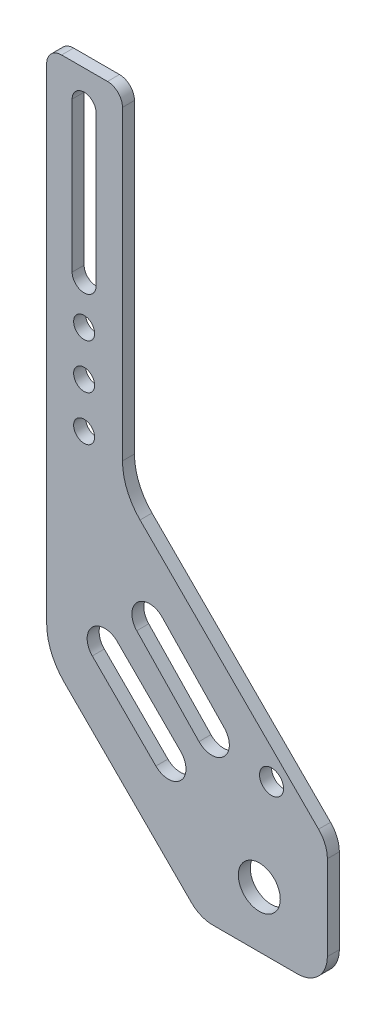
ISO-10303-21;
HEADER;
FILE_DESCRIPTION(('STEP AP214'),'2;1');
FILE_NAME('part.step','',(''),(''),'','','');
FILE_SCHEMA(('AUTOMOTIVE_DESIGN { 1 0 10303 214 1 1 1 1 }'));
ENDSEC;
DATA;
#1=APPLICATION_CONTEXT('core data for automotive mechanical design processes');
#2=APPLICATION_PROTOCOL_DEFINITION('international standard','automotive_design',2000,#1);
#3=PRODUCT_CONTEXT('',#1,'mechanical');
#4=PRODUCT('Part','Part','',(#3));
#5=PRODUCT_RELATED_PRODUCT_CATEGORY('part','',(#4));
#6=PRODUCT_DEFINITION_FORMATION('','',#4);
#7=PRODUCT_DEFINITION_CONTEXT('part definition',#1,'design');
#8=PRODUCT_DEFINITION('design','',#6,#7);
#9=PRODUCT_DEFINITION_SHAPE('','',#8);
#10=(LENGTH_UNIT() NAMED_UNIT(*) SI_UNIT(.MILLI.,.METRE.));
#11=(NAMED_UNIT(*) PLANE_ANGLE_UNIT() SI_UNIT($,.RADIAN.));
#12=(NAMED_UNIT(*) SI_UNIT($,.STERADIAN.) SOLID_ANGLE_UNIT());
#13=UNCERTAINTY_MEASURE_WITH_UNIT(LENGTH_MEASURE(1.E-05),#10,'distance_accuracy_value','');
#14=(GEOMETRIC_REPRESENTATION_CONTEXT(3) GLOBAL_UNCERTAINTY_ASSIGNED_CONTEXT((#13)) GLOBAL_UNIT_ASSIGNED_CONTEXT((#10,
#11,#12)) REPRESENTATION_CONTEXT('',''));
#15=CARTESIAN_POINT('',(0.,0.,0.));
#16=DIRECTION('',(0.,0.,1.));
#17=DIRECTION('',(1.,0.,0.));
#18=AXIS2_PLACEMENT_3D('',#15,#16,#17);
#19=CARTESIAN_POINT('',(0.,-96.2377499931107,4.));
#20=DIRECTION('',(0.,1.,0.));
#21=DIRECTION('',(0.,0.,1.));
#22=AXIS2_PLACEMENT_3D('',#19,#20,#21);
#23=PLANE('',#22);
#24=DIRECTION('',(1.,0.,0.));
#25=VECTOR('',#24,1.);
#26=CARTESIAN_POINT('',(0.,-96.2377499931107,0.));
#27=LINE('',#26,#25);
#28=CARTESIAN_POINT('',(55.3798856168415,-96.2377499931107,0.));
#29=VERTEX_POINT('',#28);
#30=CARTESIAN_POINT('',(83.6641568643034,-96.2377499931107,0.));
#31=VERTEX_POINT('',#30);
#32=EDGE_CURVE('E299',#29,#31,#27,.T.);
#33=ORIENTED_EDGE('',*,*,#32,.T.);
#34=DIRECTION('',(0.,0.,-1.));
#35=VECTOR('',#34,1.);
#36=CARTESIAN_POINT('',(83.6641568643034,-96.2377499931107,4.));
#37=LINE('',#36,#35);
#38=CARTESIAN_POINT('',(83.6641568643034,-96.2377499931107,4.));
#39=VERTEX_POINT('',#38);
#40=EDGE_CURVE('E11',#39,#31,#37,.T.);
#41=ORIENTED_EDGE('',*,*,#40,.F.);
#42=DIRECTION('',(1.,0.,0.));
#43=VECTOR('',#42,1.);
#44=CARTESIAN_POINT('',(0.,-96.2377499931107,4.));
#45=LINE('',#44,#43);
#46=CARTESIAN_POINT('',(55.3798856168415,-96.2377499931107,4.));
#47=VERTEX_POINT('',#46);
#48=EDGE_CURVE('E441',#47,#39,#45,.T.);
#49=ORIENTED_EDGE('',*,*,#48,.F.);
#50=DIRECTION('',(0.,0.,-1.));
#51=VECTOR('',#50,1.);
#52=CARTESIAN_POINT('',(55.3798856168415,-96.2377499931107,4.));
#53=LINE('',#52,#51);
#54=EDGE_CURVE('E331',#47,#29,#53,.T.);
#55=ORIENTED_EDGE('',*,*,#54,.T.);
#56=EDGE_LOOP('',(#33,#41,#49,#55));
#57=FACE_BOUND('',#56,.T.);
#58=ADVANCED_FACE('F41',(#57),#23,.F.);
#59=CARTESIAN_POINT('',(83.6641568643035,-86.2377499931107,4.));
#60=DIRECTION('',(0.,0.,-1.));
#61=DIRECTION('',(-1.,0.,0.));
#62=AXIS2_PLACEMENT_3D('',#59,#60,#61);
#63=CYLINDRICAL_SURFACE('',#62,9.99999999999999);
#64=CARTESIAN_POINT('',(83.6641568643035,-86.2377499931107,0.));
#65=DIRECTION('',(0.,0.,1.));
#66=DIRECTION('',(1.,0.,0.));
#67=AXIS2_PLACEMENT_3D('',#64,#65,#66);
#68=CIRCLE('',#67,9.99999999999999);
#69=CARTESIAN_POINT('',(93.6641568643035,-86.2377499931106,0.));
#70=VERTEX_POINT('',#69);
#71=EDGE_CURVE('E302',#31,#70,#68,.T.);
#72=ORIENTED_EDGE('',*,*,#71,.T.);
#73=DIRECTION('',(0.,0.,-1.));
#74=VECTOR('',#73,1.);
#75=CARTESIAN_POINT('',(93.6641568643035,-86.2377499931106,4.));
#76=LINE('',#75,#74);
#77=CARTESIAN_POINT('',(93.6641568643035,-86.2377499931106,4.));
#78=VERTEX_POINT('',#77);
#79=EDGE_CURVE('E51',#78,#70,#76,.T.);
#80=ORIENTED_EDGE('',*,*,#79,.F.);
#81=CARTESIAN_POINT('',(83.6641568643035,-86.2377499931107,4.));
#82=DIRECTION('',(0.,0.,1.));
#83=DIRECTION('',(1.,0.,0.));
#84=AXIS2_PLACEMENT_3D('',#81,#82,#83);
#85=CIRCLE('',#84,9.99999999999999);
#86=EDGE_CURVE('E443',#39,#78,#85,.T.);
#87=ORIENTED_EDGE('',*,*,#86,.F.);
#88=ORIENTED_EDGE('',*,*,#40,.T.);
#89=EDGE_LOOP('',(#72,#80,#87,#88));
#90=FACE_BOUND('',#89,.T.);
#91=ADVANCED_FACE('F486',(#90),#63,.T.);
#92=CARTESIAN_POINT('',(93.6641568643035,0.,4.));
#93=DIRECTION('',(-1.,0.,0.));
#94=DIRECTION('',(0.,0.,1.));
#95=AXIS2_PLACEMENT_3D('',#92,#93,#94);
#96=PLANE('',#95);
#97=DIRECTION('',(0.,1.,0.));
#98=VECTOR('',#97,1.);
#99=CARTESIAN_POINT('',(93.6641568643035,0.,0.));
#100=LINE('',#99,#98);
#101=CARTESIAN_POINT('',(93.6641568643035,-57.9534787456488,0.));
#102=VERTEX_POINT('',#101);
#103=EDGE_CURVE('E304',#70,#102,#100,.T.);
#104=ORIENTED_EDGE('',*,*,#103,.T.);
#105=DIRECTION('',(0.,0.,-1.));
#106=VECTOR('',#105,1.);
#107=CARTESIAN_POINT('',(93.6641568643035,-57.9534787456488,4.));
#108=LINE('',#107,#106);
#109=CARTESIAN_POINT('',(93.6641568643035,-57.9534787456488,4.));
#110=VERTEX_POINT('',#109);
#111=EDGE_CURVE('E353',#110,#102,#108,.T.);
#112=ORIENTED_EDGE('',*,*,#111,.F.);
#113=DIRECTION('',(0.,1.,0.));
#114=VECTOR('',#113,1.);
#115=CARTESIAN_POINT('',(93.6641568643035,0.,4.));
#116=LINE('',#115,#114);
#117=EDGE_CURVE('E445',#78,#110,#116,.T.);
#118=ORIENTED_EDGE('',*,*,#117,.F.);
#119=ORIENTED_EDGE('',*,*,#79,.T.);
#120=EDGE_LOOP('',(#104,#112,#118,#119));
#121=FACE_BOUND('',#120,.T.);
#122=ADVANCED_FACE('F491',(#121),#96,.F.);
#123=CARTESIAN_POINT('',(83.6641568643035,-57.9534787456487,4.));
#124=DIRECTION('',(0.,0.,-1.));
#125=DIRECTION('',(-1.,0.,0.));
#126=AXIS2_PLACEMENT_3D('',#123,#124,#125);
#127=CYLINDRICAL_SURFACE('',#126,10.);
#128=CARTESIAN_POINT('',(83.6641568643035,-57.9534787456487,0.));
#129=DIRECTION('',(0.,0.,1.));
#130=DIRECTION('',(1.,0.,0.));
#131=AXIS2_PLACEMENT_3D('',#128,#129,#130);
#132=CIRCLE('',#131,10.);
#133=CARTESIAN_POINT('',(90.7352246761689,-50.8824109337832,0.));
#134=VERTEX_POINT('',#133);
#135=EDGE_CURVE('E306',#102,#134,#132,.T.);
#136=ORIENTED_EDGE('',*,*,#135,.T.);
#137=DIRECTION('',(0.,0.,-1.));
#138=VECTOR('',#137,1.);
#139=CARTESIAN_POINT('',(90.7352246761689,-50.8824109337832,4.));
#140=LINE('',#139,#138);
#141=CARTESIAN_POINT('',(90.7352246761689,-50.8824109337832,4.));
#142=VERTEX_POINT('',#141);
#143=EDGE_CURVE('E350',#142,#134,#140,.T.);
#144=ORIENTED_EDGE('',*,*,#143,.F.);
#145=CARTESIAN_POINT('',(83.6641568643035,-57.9534787456487,4.));
#146=DIRECTION('',(0.,0.,1.));
#147=DIRECTION('',(1.,0.,0.));
#148=AXIS2_PLACEMENT_3D('',#145,#146,#147);
#149=CIRCLE('',#148,10.);
#150=EDGE_CURVE('E447',#110,#142,#149,.T.);
#151=ORIENTED_EDGE('',*,*,#150,.F.);
#152=ORIENTED_EDGE('',*,*,#111,.T.);
#153=EDGE_LOOP('',(#136,#144,#151,#152));
#154=FACE_BOUND('',#153,.T.);
#155=ADVANCED_FACE('F642',(#154),#127,.T.);
#156=CARTESIAN_POINT('',(19.9264068711924,19.9264068711926,4.));
#157=DIRECTION('',(-0.707106781186544,-0.707106781186551,0.));
#158=DIRECTION('',(0.707106781186551,-0.707106781186544,0.));
#159=AXIS2_PLACEMENT_3D('',#156,#157,#158);
#160=PLANE('',#159);
#161=DIRECTION('',(-0.707106781186551,0.707106781186544,0.));
#162=VECTOR('',#161,1.);
#163=CARTESIAN_POINT('',(19.9264068711924,19.9264068711926,0.));
#164=LINE('',#163,#162);
#165=CARTESIAN_POINT('',(31.159701747021,8.69311199536404,0.));
#166=VERTEX_POINT('',#165);
#167=EDGE_CURVE('E308',#134,#166,#164,.T.);
#168=ORIENTED_EDGE('',*,*,#167,.T.);
#169=DIRECTION('',(0.,0.,-1.));
#170=VECTOR('',#169,1.);
#171=CARTESIAN_POINT('',(31.159701747021,8.69311199536404,4.));
#172=LINE('',#171,#170);
#173=CARTESIAN_POINT('',(31.159701747021,8.69311199536404,4.));
#174=VERTEX_POINT('',#173);
#175=EDGE_CURVE('E347',#174,#166,#172,.T.);
#176=ORIENTED_EDGE('',*,*,#175,.F.);
#177=DIRECTION('',(-0.707106781186551,0.707106781186544,0.));
#178=VECTOR('',#177,1.);
#179=CARTESIAN_POINT('',(19.9264068711924,19.9264068711926,4.));
#180=LINE('',#179,#178);
#181=EDGE_CURVE('E449',#142,#174,#180,.T.);
#182=ORIENTED_EDGE('',*,*,#181,.F.);
#183=ORIENTED_EDGE('',*,*,#143,.T.);
#184=EDGE_LOOP('',(#168,#176,#182,#183));
#185=FACE_BOUND('',#184,.T.);
#186=ADVANCED_FACE('F634',(#185),#160,.F.);
#187=CARTESIAN_POINT('',(45.3018373707518,22.8352476190951,4.));
#188=DIRECTION('',(0.,0.,-1.));
#189=DIRECTION('',(-1.,0.,0.));
#190=AXIS2_PLACEMENT_3D('',#187,#188,#189);
#191=CYLINDRICAL_SURFACE('',#190,20.);
#192=CARTESIAN_POINT('',(45.3018373707518,22.8352476190951,0.));
#193=DIRECTION('',(0.,0.,1.));
#194=DIRECTION('',(1.,0.,0.));
#195=AXIS2_PLACEMENT_3D('',#192,#193,#194);
#196=CIRCLE('',#195,20.);
#197=CARTESIAN_POINT('',(25.3018373707518,22.8352476190952,0.));
#198=VERTEX_POINT('',#197);
#199=EDGE_CURVE('E310',#166,#198,#196,.F.);
#200=ORIENTED_EDGE('',*,*,#199,.T.);
#201=DIRECTION('',(0.,0.,-1.));
#202=VECTOR('',#201,1.);
#203=CARTESIAN_POINT('',(25.3018373707518,22.8352476190952,4.));
#204=LINE('',#203,#202);
#205=CARTESIAN_POINT('',(25.3018373707518,22.8352476190952,4.));
#206=VERTEX_POINT('',#205);
#207=EDGE_CURVE('E344',#206,#198,#204,.T.);
#208=ORIENTED_EDGE('',*,*,#207,.F.);
#209=CARTESIAN_POINT('',(45.3018373707518,22.8352476190951,4.));
#210=DIRECTION('',(0.,0.,1.));
#211=DIRECTION('',(1.,0.,0.));
#212=AXIS2_PLACEMENT_3D('',#209,#210,#211);
#213=CIRCLE('',#212,20.);
#214=EDGE_CURVE('E451',#174,#206,#213,.F.);
#215=ORIENTED_EDGE('',*,*,#214,.F.);
#216=ORIENTED_EDGE('',*,*,#175,.T.);
#217=EDGE_LOOP('',(#200,#208,#215,#216));
#218=FACE_BOUND('',#217,.T.);
#219=ADVANCED_FACE('F626',(#218),#191,.F.);
#220=CARTESIAN_POINT('',(25.3018373707518,0.,4.));
#221=DIRECTION('',(-1.,0.,0.));
#222=DIRECTION('',(0.,-1.,0.));
#223=AXIS2_PLACEMENT_3D('',#220,#221,#222);
#224=PLANE('',#223);
#225=DIRECTION('',(0.,1.,0.));
#226=VECTOR('',#225,1.);
#227=CARTESIAN_POINT('',(25.3018373707518,0.,0.));
#228=LINE('',#227,#226);
#229=CARTESIAN_POINT('',(25.3018373707518,125.,0.));
#230=VERTEX_POINT('',#229);
#231=EDGE_CURVE('E312',#198,#230,#228,.T.);
#232=ORIENTED_EDGE('',*,*,#231,.T.);
#233=DIRECTION('',(0.,0.,-1.));
#234=VECTOR('',#233,1.);
#235=CARTESIAN_POINT('',(25.3018373707518,125.,4.));
#236=LINE('',#235,#234);
#237=CARTESIAN_POINT('',(25.3018373707518,125.,4.));
#238=VERTEX_POINT('',#237);
#239=EDGE_CURVE('E342',#238,#230,#236,.T.);
#240=ORIENTED_EDGE('',*,*,#239,.F.);
#241=DIRECTION('',(0.,1.,0.));
#242=VECTOR('',#241,1.);
#243=CARTESIAN_POINT('',(25.3018373707518,0.,4.));
#244=LINE('',#243,#242);
#245=EDGE_CURVE('E453',#206,#238,#244,.T.);
#246=ORIENTED_EDGE('',*,*,#245,.F.);
#247=ORIENTED_EDGE('',*,*,#207,.T.);
#248=EDGE_LOOP('',(#232,#240,#246,#247));
#249=FACE_BOUND('',#248,.T.);
#250=ADVANCED_FACE('F618',(#249),#224,.F.);
#251=CARTESIAN_POINT('',(20.3018373707518,125.,4.));
#252=DIRECTION('',(0.,0.,-1.));
#253=DIRECTION('',(-1.,0.,0.));
#254=AXIS2_PLACEMENT_3D('',#251,#252,#253);
#255=CYLINDRICAL_SURFACE('',#254,5.);
#256=CARTESIAN_POINT('',(20.3018373707518,125.,0.));
#257=DIRECTION('',(0.,0.,1.));
#258=DIRECTION('',(1.,0.,0.));
#259=AXIS2_PLACEMENT_3D('',#256,#257,#258);
#260=CIRCLE('',#259,5.);
#261=CARTESIAN_POINT('',(20.3018373707518,130.,0.));
#262=VERTEX_POINT('',#261);
#263=EDGE_CURVE('E315',#262,#230,#260,.F.);
#264=ORIENTED_EDGE('',*,*,#263,.F.);
#265=DIRECTION('',(0.,0.,-1.));
#266=VECTOR('',#265,1.);
#267=CARTESIAN_POINT('',(20.3018373707518,130.,4.));
#268=LINE('',#267,#266);
#269=CARTESIAN_POINT('',(20.3018373707518,130.,4.));
#270=VERTEX_POINT('',#269);
#271=EDGE_CURVE('E340',#270,#262,#268,.T.);
#272=ORIENTED_EDGE('',*,*,#271,.F.);
#273=CARTESIAN_POINT('',(20.3018373707518,125.,4.));
#274=DIRECTION('',(0.,0.,1.));
#275=DIRECTION('',(1.,0.,0.));
#276=AXIS2_PLACEMENT_3D('',#273,#274,#275);
#277=CIRCLE('',#276,5.);
#278=EDGE_CURVE('E455',#270,#238,#277,.F.);
#279=ORIENTED_EDGE('',*,*,#278,.T.);
#280=ORIENTED_EDGE('',*,*,#239,.T.);
#281=EDGE_LOOP('',(#264,#272,#279,#280));
#282=FACE_BOUND('',#281,.T.);
#283=ADVANCED_FACE('F610',(#282),#255,.T.);
#284=CARTESIAN_POINT('',(0.,130.,4.));
#285=DIRECTION('',(0.,1.,0.));
#286=DIRECTION('',(0.,0.,1.));
#287=AXIS2_PLACEMENT_3D('',#284,#285,#286);
#288=PLANE('',#287);
#289=DIRECTION('',(1.,0.,0.));
#290=VECTOR('',#289,1.);
#291=CARTESIAN_POINT('',(0.,130.,0.));
#292=LINE('',#291,#290);
#293=CARTESIAN_POINT('',(5.,130.,0.));
#294=VERTEX_POINT('',#293);
#295=EDGE_CURVE('E318',#294,#262,#292,.T.);
#296=ORIENTED_EDGE('',*,*,#295,.F.);
#297=DIRECTION('',(0.,0.,-1.));
#298=VECTOR('',#297,1.);
#299=CARTESIAN_POINT('',(5.,130.,4.));
#300=LINE('',#299,#298);
#301=CARTESIAN_POINT('',(5.,130.,4.));
#302=VERTEX_POINT('',#301);
#303=EDGE_CURVE('E338',#302,#294,#300,.T.);
#304=ORIENTED_EDGE('',*,*,#303,.F.);
#305=DIRECTION('',(1.,0.,0.));
#306=VECTOR('',#305,1.);
#307=CARTESIAN_POINT('',(0.,130.,4.));
#308=LINE('',#307,#306);
#309=EDGE_CURVE('E458',#302,#270,#308,.T.);
#310=ORIENTED_EDGE('',*,*,#309,.T.);
#311=ORIENTED_EDGE('',*,*,#271,.T.);
#312=EDGE_LOOP('',(#296,#304,#310,#311));
#313=FACE_BOUND('',#312,.T.);
#314=ADVANCED_FACE('F602',(#313),#288,.T.);
#315=CARTESIAN_POINT('',(5.,125.,4.));
#316=DIRECTION('',(0.,0.,-1.));
#317=DIRECTION('',(-1.,0.,0.));
#318=AXIS2_PLACEMENT_3D('',#315,#316,#317);
#319=CYLINDRICAL_SURFACE('',#318,5.);
#320=CARTESIAN_POINT('',(5.,125.,0.));
#321=DIRECTION('',(0.,0.,1.));
#322=DIRECTION('',(1.,0.,0.));
#323=AXIS2_PLACEMENT_3D('',#320,#321,#322);
#324=CIRCLE('',#323,5.);
#325=CARTESIAN_POINT('',(0.,125.,0.));
#326=VERTEX_POINT('',#325);
#327=EDGE_CURVE('E321',#294,#326,#324,.T.);
#328=ORIENTED_EDGE('',*,*,#327,.T.);
#329=DIRECTION('',(0.,0.,-1.));
#330=VECTOR('',#329,1.);
#331=CARTESIAN_POINT('',(0.,125.,4.));
#332=LINE('',#331,#330);
#333=CARTESIAN_POINT('',(0.,125.,4.));
#334=VERTEX_POINT('',#333);
#335=EDGE_CURVE('E336',#334,#326,#332,.T.);
#336=ORIENTED_EDGE('',*,*,#335,.F.);
#337=CARTESIAN_POINT('',(5.,125.,4.));
#338=DIRECTION('',(0.,0.,1.));
#339=DIRECTION('',(1.,0.,0.));
#340=AXIS2_PLACEMENT_3D('',#337,#338,#339);
#341=CIRCLE('',#340,5.);
#342=EDGE_CURVE('E461',#302,#334,#341,.T.);
#343=ORIENTED_EDGE('',*,*,#342,.F.);
#344=ORIENTED_EDGE('',*,*,#303,.T.);
#345=EDGE_LOOP('',(#328,#336,#343,#344));
#346=FACE_BOUND('',#345,.T.);
#347=ADVANCED_FACE('F595',(#346),#319,.T.);
#348=CARTESIAN_POINT('',(0.,0.,4.));
#349=DIRECTION('',(-1.,0.,0.));
#350=DIRECTION('',(0.,0.,1.));
#351=AXIS2_PLACEMENT_3D('',#348,#349,#350);
#352=PLANE('',#351);
#353=DIRECTION('',(0.,1.,0.));
#354=VECTOR('',#353,1.);
#355=CARTESIAN_POINT('',(0.,0.,0.));
#356=LINE('',#355,#354);
#357=CARTESIAN_POINT('',(0.,-36.715728752538,0.));
#358=VERTEX_POINT('',#357);
#359=EDGE_CURVE('E324',#358,#326,#356,.T.);
#360=ORIENTED_EDGE('',*,*,#359,.F.);
#361=DIRECTION('',(0.,0.,-1.));
#362=VECTOR('',#361,1.);
#363=CARTESIAN_POINT('',(0.,-36.715728752538,4.));
#364=LINE('',#363,#362);
#365=CARTESIAN_POINT('',(0.,-36.715728752538,4.));
#366=VERTEX_POINT('',#365);
#367=EDGE_CURVE('E240',#366,#358,#364,.T.);
#368=ORIENTED_EDGE('',*,*,#367,.F.);
#369=DIRECTION('',(0.,1.,0.));
#370=VECTOR('',#369,1.);
#371=CARTESIAN_POINT('',(0.,0.,4.));
#372=LINE('',#371,#370);
#373=EDGE_CURVE('E233',#366,#334,#372,.T.);
#374=ORIENTED_EDGE('',*,*,#373,.T.);
#375=ORIENTED_EDGE('',*,*,#335,.T.);
#376=EDGE_LOOP('',(#360,#368,#374,#375));
#377=FACE_BOUND('',#376,.T.);
#378=ADVANCED_FACE('F464',(#377),#352,.T.);
#379=CARTESIAN_POINT('',(20.,-36.7157287525381,4.));
#380=DIRECTION('',(0.,0.,-1.));
#381=DIRECTION('',(-1.,0.,0.));
#382=AXIS2_PLACEMENT_3D('',#379,#380,#381);
#383=CYLINDRICAL_SURFACE('',#382,20.);
#384=CARTESIAN_POINT('',(20.,-36.7157287525381,0.));
#385=DIRECTION('',(0.,0.,1.));
#386=DIRECTION('',(1.,0.,0.));
#387=AXIS2_PLACEMENT_3D('',#384,#385,#386);
#388=CIRCLE('',#387,20.);
#389=CARTESIAN_POINT('',(5.85786437626909,-50.8578643762691,0.));
#390=VERTEX_POINT('',#389);
#391=EDGE_CURVE('E239',#358,#390,#388,.T.);
#392=ORIENTED_EDGE('',*,*,#391,.T.);
#393=DIRECTION('',(0.,0.,-1.));
#394=VECTOR('',#393,1.);
#395=CARTESIAN_POINT('',(5.85786437626909,-50.8578643762691,4.));
#396=LINE('',#395,#394);
#397=CARTESIAN_POINT('',(5.85786437626909,-50.8578643762691,4.));
#398=VERTEX_POINT('',#397);
#399=EDGE_CURVE('E236',#398,#390,#396,.T.);
#400=ORIENTED_EDGE('',*,*,#399,.F.);
#401=CARTESIAN_POINT('',(20.,-36.7157287525381,4.));
#402=DIRECTION('',(0.,0.,1.));
#403=DIRECTION('',(1.,0.,0.));
#404=AXIS2_PLACEMENT_3D('',#401,#402,#403);
#405=CIRCLE('',#404,20.);
#406=EDGE_CURVE('E227',#366,#398,#405,.T.);
#407=ORIENTED_EDGE('',*,*,#406,.F.);
#408=ORIENTED_EDGE('',*,*,#367,.T.);
#409=EDGE_LOOP('',(#392,#400,#407,#408));
#410=FACE_BOUND('',#409,.T.);
#411=ADVANCED_FACE('F237',(#410),#383,.T.);
#412=CARTESIAN_POINT('',(-22.5,-22.4999999999999,4.));
#413=DIRECTION('',(0.707106781186549,0.707106781186546,0.));
#414=DIRECTION('',(-0.707106781186546,0.707106781186549,0.));
#415=AXIS2_PLACEMENT_3D('',#412,#413,#414);
#416=PLANE('',#415);
#417=DIRECTION('',(0.707106781186546,-0.707106781186549,0.));
#418=VECTOR('',#417,1.);
#419=CARTESIAN_POINT('',(-22.5,-22.4999999999999,0.));
#420=LINE('',#419,#418);
#421=CARTESIAN_POINT('',(48.3088178049759,-93.3088178049761,0.));
#422=VERTEX_POINT('',#421);
#423=EDGE_CURVE('E143',#390,#422,#420,.T.);
#424=ORIENTED_EDGE('',*,*,#423,.T.);
#425=DIRECTION('',(0.,0.,-1.));
#426=VECTOR('',#425,1.);
#427=CARTESIAN_POINT('',(48.3088178049759,-93.3088178049761,4.));
#428=LINE('',#427,#426);
#429=CARTESIAN_POINT('',(48.3088178049759,-93.3088178049761,4.));
#430=VERTEX_POINT('',#429);
#431=EDGE_CURVE('E241',#430,#422,#428,.T.);
#432=ORIENTED_EDGE('',*,*,#431,.F.);
#433=DIRECTION('',(0.707106781186546,-0.707106781186549,0.));
#434=VECTOR('',#433,1.);
#435=CARTESIAN_POINT('',(-22.5,-22.4999999999999,4.));
#436=LINE('',#435,#434);
#437=EDGE_CURVE('E231',#398,#430,#436,.T.);
#438=ORIENTED_EDGE('',*,*,#437,.F.);
#439=ORIENTED_EDGE('',*,*,#399,.T.);
#440=EDGE_LOOP('',(#424,#432,#438,#439));
#441=FACE_BOUND('',#440,.T.);
#442=ADVANCED_FACE('F243',(#441),#416,.F.);
#443=CARTESIAN_POINT('',(40.6066017177982,-55.6066017177982,4.));
#444=DIRECTION('',(0.,0.,-1.));
#445=DIRECTION('',(-1.,0.,0.));
#446=AXIS2_PLACEMENT_3D('',#443,#444,#445);
#447=CYLINDRICAL_SURFACE('',#446,5.88335792138499);
#448=CARTESIAN_POINT('',(40.6066017177982,-55.6066017177982,0.));
#449=DIRECTION('',(0.,0.,1.));
#450=DIRECTION('',(1.,0.,0.));
#451=AXIS2_PLACEMENT_3D('',#448,#449,#450);
#452=CIRCLE('',#451,5.88335792138499);
#453=CARTESIAN_POINT('',(36.4464394354393,-59.7667640001571,0.));
#454=VERTEX_POINT('',#453);
#455=CARTESIAN_POINT('',(44.7667640001571,-51.4464394354393,0.));
#456=VERTEX_POINT('',#455);
#457=EDGE_CURVE('E281',#454,#456,#452,.T.);
#458=ORIENTED_EDGE('',*,*,#457,.F.);
#459=DIRECTION('',(0.,0.,-1.));
#460=VECTOR('',#459,1.);
#461=CARTESIAN_POINT('',(36.4464394354393,-59.7667640001571,4.));
#462=LINE('',#461,#460);
#463=CARTESIAN_POINT('',(36.4464394354393,-59.7667640001571,4.));
#464=VERTEX_POINT('',#463);
#465=EDGE_CURVE('E333',#464,#454,#462,.T.);
#466=ORIENTED_EDGE('',*,*,#465,.F.);
#467=CARTESIAN_POINT('',(40.6066017177982,-55.6066017177982,4.));
#468=DIRECTION('',(0.,0.,1.));
#469=DIRECTION('',(1.,0.,0.));
#470=AXIS2_PLACEMENT_3D('',#467,#468,#469);
#471=CIRCLE('',#470,5.88335792138499);
#472=CARTESIAN_POINT('',(44.7667640001571,-51.4464394354393,4.));
#473=VERTEX_POINT('',#472);
#474=EDGE_CURVE('E424',#464,#473,#471,.T.);
#475=ORIENTED_EDGE('',*,*,#474,.T.);
#476=DIRECTION('',(0.,0.,-1.));
#477=VECTOR('',#476,1.);
#478=CARTESIAN_POINT('',(44.7667640001571,-51.4464394354393,4.));
#479=LINE('',#478,#477);
#480=EDGE_CURVE('E358',#473,#456,#479,.T.);
#481=ORIENTED_EDGE('',*,*,#480,.T.);
#482=EDGE_LOOP('',(#458,#466,#475,#481));
#483=FACE_BOUND('',#482,.T.);
#484=ADVANCED_FACE('F517',(#483),#447,.F.);
#485=CARTESIAN_POINT('',(-11.6601622823589,-11.6601622823589,4.));
#486=DIRECTION('',(0.707106781186547,0.707106781186548,0.));
#487=DIRECTION('',(-0.707106781186548,0.707106781186547,0.));
#488=AXIS2_PLACEMENT_3D('',#485,#486,#487);
#489=PLANE('',#488);
#490=DIRECTION('',(0.707106781186548,-0.707106781186547,0.));
#491=VECTOR('',#490,1.);
#492=CARTESIAN_POINT('',(-11.6601622823589,-11.6601622823589,0.));
#493=LINE('',#492,#491);
#494=CARTESIAN_POINT('',(15.2332359998429,-38.5535605645607,0.));
#495=VERTEX_POINT('',#494);
#496=EDGE_CURVE('E284',#495,#454,#493,.T.);
#497=ORIENTED_EDGE('',*,*,#496,.F.);
#498=DIRECTION('',(0.,0.,-1.));
#499=VECTOR('',#498,1.);
#500=CARTESIAN_POINT('',(15.2332359998429,-38.5535605645607,4.));
#501=LINE('',#500,#499);
#502=CARTESIAN_POINT('',(15.2332359998429,-38.5535605645607,4.));
#503=VERTEX_POINT('',#502);
#504=EDGE_CURVE('E363',#503,#495,#501,.T.);
#505=ORIENTED_EDGE('',*,*,#504,.F.);
#506=DIRECTION('',(0.707106781186548,-0.707106781186547,0.));
#507=VECTOR('',#506,1.);
#508=CARTESIAN_POINT('',(-11.6601622823589,-11.6601622823589,4.));
#509=LINE('',#508,#507);
#510=EDGE_CURVE('E427',#503,#464,#509,.T.);
#511=ORIENTED_EDGE('',*,*,#510,.T.);
#512=ORIENTED_EDGE('',*,*,#465,.T.);
#513=EDGE_LOOP('',(#497,#505,#511,#512));
#514=FACE_BOUND('',#513,.T.);
#515=ADVANCED_FACE('F513',(#514),#489,.T.);
#516=CARTESIAN_POINT('',(19.3933982822018,-34.3933982822018,4.));
#517=DIRECTION('',(0.,0.,-1.));
#518=DIRECTION('',(-1.,0.,0.));
#519=AXIS2_PLACEMENT_3D('',#516,#517,#518);
#520=CYLINDRICAL_SURFACE('',#519,5.88335792138499);
#521=CARTESIAN_POINT('',(19.3933982822018,-34.3933982822018,0.));
#522=DIRECTION('',(0.,0.,1.));
#523=DIRECTION('',(1.,0.,0.));
#524=AXIS2_PLACEMENT_3D('',#521,#522,#523);
#525=CIRCLE('',#524,5.88335792138499);
#526=CARTESIAN_POINT('',(23.5535605645607,-30.2332359998429,0.));
#527=VERTEX_POINT('',#526);
#528=EDGE_CURVE('E287',#527,#495,#525,.T.);
#529=ORIENTED_EDGE('',*,*,#528,.F.);
#530=DIRECTION('',(0.,0.,-1.));
#531=VECTOR('',#530,1.);
#532=CARTESIAN_POINT('',(23.5535605645607,-30.2332359998429,4.));
#533=LINE('',#532,#531);
#534=CARTESIAN_POINT('',(23.5535605645607,-30.2332359998429,4.));
#535=VERTEX_POINT('',#534);
#536=EDGE_CURVE('E360',#535,#527,#533,.T.);
#537=ORIENTED_EDGE('',*,*,#536,.F.);
#538=CARTESIAN_POINT('',(19.3933982822018,-34.3933982822018,4.));
#539=DIRECTION('',(0.,0.,1.));
#540=DIRECTION('',(1.,0.,0.));
#541=AXIS2_PLACEMENT_3D('',#538,#539,#540);
#542=CIRCLE('',#541,5.88335792138499);
#543=EDGE_CURVE('E430',#535,#503,#542,.T.);
#544=ORIENTED_EDGE('',*,*,#543,.T.);
#545=ORIENTED_EDGE('',*,*,#504,.T.);
#546=EDGE_LOOP('',(#529,#537,#544,#545));
#547=FACE_BOUND('',#546,.T.);
#548=ADVANCED_FACE('F509',(#547),#520,.F.);
#549=CARTESIAN_POINT('',(12.5,69.,4.));
#550=DIRECTION('',(0.,0.,-1.));
#551=DIRECTION('',(-1.,0.,0.));
#552=AXIS2_PLACEMENT_3D('',#549,#550,#551);
#553=CYLINDRICAL_SURFACE('',#552,4.);
#554=CARTESIAN_POINT('',(12.5,69.,0.));
#555=DIRECTION('',(0.,0.,1.));
#556=DIRECTION('',(1.,0.,0.));
#557=AXIS2_PLACEMENT_3D('',#554,#555,#556);
#558=CIRCLE('',#557,4.);
#559=CARTESIAN_POINT('',(8.49999999999998,69.,0.));
#560=VERTEX_POINT('',#559);
#561=CARTESIAN_POINT('',(16.5,69.,0.));
#562=VERTEX_POINT('',#561);
#563=EDGE_CURVE('E260',#560,#562,#558,.T.);
#564=ORIENTED_EDGE('',*,*,#563,.F.);
#565=DIRECTION('',(0.,0.,-1.));
#566=VECTOR('',#565,1.);
#567=CARTESIAN_POINT('',(8.49999999999998,69.,4.));
#568=LINE('',#567,#566);
#569=CARTESIAN_POINT('',(8.49999999999998,69.,4.));
#570=VERTEX_POINT('',#569);
#571=EDGE_CURVE('E361',#570,#560,#568,.T.);
#572=ORIENTED_EDGE('',*,*,#571,.F.);
#573=CARTESIAN_POINT('',(12.5,69.,4.));
#574=DIRECTION('',(0.,0.,1.));
#575=DIRECTION('',(1.,0.,0.));
#576=AXIS2_PLACEMENT_3D('',#573,#574,#575);
#577=CIRCLE('',#576,4.);
#578=CARTESIAN_POINT('',(16.5,69.,4.));
#579=VERTEX_POINT('',#578);
#580=EDGE_CURVE('E398',#570,#579,#577,.T.);
#581=ORIENTED_EDGE('',*,*,#580,.T.);
#582=DIRECTION('',(0.,0.,-1.));
#583=VECTOR('',#582,1.);
#584=CARTESIAN_POINT('',(16.5,69.,4.));
#585=LINE('',#584,#583);
#586=EDGE_CURVE('E366',#579,#562,#585,.T.);
#587=ORIENTED_EDGE('',*,*,#586,.T.);
#588=EDGE_LOOP('',(#564,#572,#581,#587));
#589=FACE_BOUND('',#588,.T.);
#590=ADVANCED_FACE('F512',(#589),#553,.F.);
#591=CARTESIAN_POINT('',(8.5,0.,4.));
#592=DIRECTION('',(1.,0.,0.));
#593=DIRECTION('',(0.,1.,0.));
#594=AXIS2_PLACEMENT_3D('',#591,#592,#593);
#595=PLANE('',#594);
#596=DIRECTION('',(0.,-1.,0.));
#597=VECTOR('',#596,1.);
#598=CARTESIAN_POINT('',(8.5,0.,0.));
#599=LINE('',#598,#597);
#600=CARTESIAN_POINT('',(8.49999999999996,119.,0.));
#601=VERTEX_POINT('',#600);
#602=EDGE_CURVE('E263',#601,#560,#599,.T.);
#603=ORIENTED_EDGE('',*,*,#602,.F.);
#604=DIRECTION('',(0.,0.,-1.));
#605=VECTOR('',#604,1.);
#606=CARTESIAN_POINT('',(8.49999999999996,119.,4.));
#607=LINE('',#606,#605);
#608=CARTESIAN_POINT('',(8.49999999999996,119.,4.));
#609=VERTEX_POINT('',#608);
#610=EDGE_CURVE('E370',#609,#601,#607,.T.);
#611=ORIENTED_EDGE('',*,*,#610,.F.);
#612=DIRECTION('',(0.,-1.,0.));
#613=VECTOR('',#612,1.);
#614=CARTESIAN_POINT('',(8.5,0.,4.));
#615=LINE('',#614,#613);
#616=EDGE_CURVE('E407',#609,#570,#615,.T.);
#617=ORIENTED_EDGE('',*,*,#616,.T.);
#618=ORIENTED_EDGE('',*,*,#571,.T.);
#619=EDGE_LOOP('',(#603,#611,#617,#618));
#620=FACE_BOUND('',#619,.T.);
#621=ADVANCED_FACE('F539',(#620),#595,.T.);
#622=CARTESIAN_POINT('',(12.5,119.,4.));
#623=DIRECTION('',(0.,0.,-1.));
#624=DIRECTION('',(-1.,0.,0.));
#625=AXIS2_PLACEMENT_3D('',#622,#623,#624);
#626=CYLINDRICAL_SURFACE('',#625,4.);
#627=CARTESIAN_POINT('',(12.5,119.,0.));
#628=DIRECTION('',(0.,0.,1.));
#629=DIRECTION('',(1.,0.,0.));
#630=AXIS2_PLACEMENT_3D('',#627,#628,#629);
#631=CIRCLE('',#630,4.);
#632=CARTESIAN_POINT('',(16.5,119.,0.));
#633=VERTEX_POINT('',#632);
#634=EDGE_CURVE('E266',#633,#601,#631,.T.);
#635=ORIENTED_EDGE('',*,*,#634,.F.);
#636=DIRECTION('',(0.,0.,-1.));
#637=VECTOR('',#636,1.);
#638=CARTESIAN_POINT('',(16.5,119.,4.));
#639=LINE('',#638,#637);
#640=CARTESIAN_POINT('',(16.5,119.,4.));
#641=VERTEX_POINT('',#640);
#642=EDGE_CURVE('E368',#641,#633,#639,.T.);
#643=ORIENTED_EDGE('',*,*,#642,.F.);
#644=CARTESIAN_POINT('',(12.5,119.,4.));
#645=DIRECTION('',(0.,0.,1.));
#646=DIRECTION('',(1.,0.,0.));
#647=AXIS2_PLACEMENT_3D('',#644,#645,#646);
#648=CIRCLE('',#647,4.);
#649=EDGE_CURVE('E410',#641,#609,#648,.T.);
#650=ORIENTED_EDGE('',*,*,#649,.T.);
#651=ORIENTED_EDGE('',*,*,#610,.T.);
#652=EDGE_LOOP('',(#635,#643,#650,#651));
#653=FACE_BOUND('',#652,.T.);
#654=ADVANCED_FACE('F536',(#653),#626,.F.);
#655=CARTESIAN_POINT('',(12.237774886856,11.7330660915952,4.));
#656=DIRECTION('',(0.721835011806536,0.69206518170636,0.));
#657=DIRECTION('',(-0.69206518170636,0.721835011806536,0.));
#658=AXIS2_PLACEMENT_3D('',#655,#656,#657);
#659=PLANE('',#658);
#660=DIRECTION('',(0.69206518170636,-0.721835011806536,0.));
#661=VECTOR('',#660,1.);
#662=CARTESIAN_POINT('',(12.237774886856,11.7330660915952,0.));
#663=LINE('',#662,#661);
#664=CARTESIAN_POINT('',(38.5557175556886,-15.716967459061,0.));
#665=VERTEX_POINT('',#664);
#666=CARTESIAN_POINT('',(59.3176730068794,-37.3720178132571,0.));
#667=VERTEX_POINT('',#666);
#668=EDGE_CURVE('E249',#665,#667,#663,.T.);
#669=ORIENTED_EDGE('',*,*,#668,.T.);
#670=DIRECTION('',(0.,0.,-1.));
#671=VECTOR('',#670,1.);
#672=CARTESIAN_POINT('',(59.3176730068794,-37.3720178132571,4.));
#673=LINE('',#672,#671);
#674=CARTESIAN_POINT('',(59.3176730068794,-37.3720178132571,4.));
#675=VERTEX_POINT('',#674);
#676=EDGE_CURVE('E45',#675,#667,#673,.T.);
#677=ORIENTED_EDGE('',*,*,#676,.F.);
#678=DIRECTION('',(0.69206518170636,-0.721835011806536,0.));
#679=VECTOR('',#678,1.);
#680=CARTESIAN_POINT('',(12.237774886856,11.7330660915952,4.));
#681=LINE('',#680,#679);
#682=CARTESIAN_POINT('',(38.5557175556886,-15.716967459061,4.));
#683=VERTEX_POINT('',#682);
#684=EDGE_CURVE('E330',#683,#675,#681,.T.);
#685=ORIENTED_EDGE('',*,*,#684,.F.);
#686=DIRECTION('',(0.,0.,-1.));
#687=VECTOR('',#686,1.);
#688=CARTESIAN_POINT('',(38.5557175556886,-15.716967459061,4.));
#689=LINE('',#688,#687);
#690=EDGE_CURVE('E245',#683,#665,#689,.T.);
#691=ORIENTED_EDGE('',*,*,#690,.T.);
#692=EDGE_LOOP('',(#669,#677,#685,#691));
#693=FACE_BOUND('',#692,.T.);
#694=ADVANCED_FACE('F43',(#693),#659,.F.);
#695=CARTESIAN_POINT('',(55.0708592722344,-41.4436849821639,4.));
#696=DIRECTION('',(0.,0.,-1.));
#697=DIRECTION('',(-1.,0.,0.));
#698=AXIS2_PLACEMENT_3D('',#695,#696,#697);
#699=CYLINDRICAL_SURFACE('',#698,5.88335792138499);
#700=CARTESIAN_POINT('',(55.0708592722344,-41.4436849821639,0.));
#701=DIRECTION('',(0.,0.,1.));
#702=DIRECTION('',(1.,0.,0.));
#703=AXIS2_PLACEMENT_3D('',#700,#701,#702);
#704=CIRCLE('',#703,5.88335792138499);
#705=CARTESIAN_POINT('',(50.8240455375894,-45.5153521510708,0.));
#706=VERTEX_POINT('',#705);
#707=EDGE_CURVE('E252',#667,#706,#704,.F.);
#708=ORIENTED_EDGE('',*,*,#707,.T.);
#709=DIRECTION('',(0.,0.,-1.));
#710=VECTOR('',#709,1.);
#711=CARTESIAN_POINT('',(50.8240455375894,-45.5153521510708,4.));
#712=LINE('',#711,#710);
#713=CARTESIAN_POINT('',(50.8240455375894,-45.5153521510708,4.));
#714=VERTEX_POINT('',#713);
#715=EDGE_CURVE('E376',#714,#706,#712,.T.);
#716=ORIENTED_EDGE('',*,*,#715,.F.);
#717=CARTESIAN_POINT('',(55.0708592722344,-41.4436849821639,4.));
#718=DIRECTION('',(0.,0.,1.));
#719=DIRECTION('',(1.,0.,0.));
#720=AXIS2_PLACEMENT_3D('',#717,#718,#719);
#721=CIRCLE('',#720,5.88335792138499);
#722=EDGE_CURVE('E158',#675,#714,#721,.F.);
#723=ORIENTED_EDGE('',*,*,#722,.F.);
#724=ORIENTED_EDGE('',*,*,#676,.T.);
#725=EDGE_LOOP('',(#708,#716,#723,#724));
#726=FACE_BOUND('',#725,.T.);
#727=ADVANCED_FACE('F381',(#726),#699,.F.);
#728=CARTESIAN_POINT('',(3.74414741756592,3.58973175378149,4.));
#729=DIRECTION('',(0.721835011806536,0.69206518170636,0.));
#730=DIRECTION('',(-0.69206518170636,0.721835011806536,0.));
#731=AXIS2_PLACEMENT_3D('',#728,#729,#730);
#732=PLANE('',#731);
#733=DIRECTION('',(0.69206518170636,-0.721835011806536,0.));
#734=VECTOR('',#733,1.);
#735=CARTESIAN_POINT('',(3.74414741756592,3.58973175378149,0.));
#736=LINE('',#735,#734);
#737=CARTESIAN_POINT('',(30.0620900863986,-23.8603017968747,0.));
#738=VERTEX_POINT('',#737);
#739=EDGE_CURVE('E255',#738,#706,#736,.T.);
#740=ORIENTED_EDGE('',*,*,#739,.F.);
#741=DIRECTION('',(0.,0.,-1.));
#742=VECTOR('',#741,1.);
#743=CARTESIAN_POINT('',(30.0620900863986,-23.8603017968747,4.));
#744=LINE('',#743,#742);
#745=CARTESIAN_POINT('',(30.0620900863986,-23.8603017968747,4.));
#746=VERTEX_POINT('',#745);
#747=EDGE_CURVE('E375',#746,#738,#744,.T.);
#748=ORIENTED_EDGE('',*,*,#747,.F.);
#749=DIRECTION('',(0.69206518170636,-0.721835011806536,0.));
#750=VECTOR('',#749,1.);
#751=CARTESIAN_POINT('',(3.74414741756592,3.58973175378149,4.));
#752=LINE('',#751,#750);
#753=EDGE_CURVE('E393',#746,#714,#752,.T.);
#754=ORIENTED_EDGE('',*,*,#753,.T.);
#755=ORIENTED_EDGE('',*,*,#715,.T.);
#756=EDGE_LOOP('',(#740,#748,#754,#755));
#757=FACE_BOUND('',#756,.T.);
#758=ADVANCED_FACE('F390',(#757),#732,.T.);
#759=CARTESIAN_POINT('',(75.03834495,-45.,4.));
#760=DIRECTION('',(0.,0.,-1.));
#761=DIRECTION('',(-1.,0.,0.));
#762=AXIS2_PLACEMENT_3D('',#759,#760,#761);
#763=CYLINDRICAL_SURFACE('',#762,4.00000000000001);
#764=CARTESIAN_POINT('',(75.03834495,-45.,4.));
#765=DIRECTION('',(0.,0.,1.));
#766=DIRECTION('',(1.,0.,0.));
#767=AXIS2_PLACEMENT_3D('',#764,#765,#766);
#768=CIRCLE('',#767,4.00000000000001);
#769=CARTESIAN_POINT('',(79.03834495,-45.,4.));
#770=VERTEX_POINT('',#769);
#771=EDGE_CURVE('E438',#770,#770,#768,.T.);
#772=ORIENTED_EDGE('',*,*,#771,.T.);
#773=EDGE_LOOP('',(#772));
#774=FACE_BOUND('',#773,.T.);
#775=CARTESIAN_POINT('',(75.03834495,-45.,0.));
#776=DIRECTION('',(0.,0.,1.));
#777=DIRECTION('',(1.,0.,0.));
#778=AXIS2_PLACEMENT_3D('',#775,#776,#777);
#779=CIRCLE('',#778,4.00000000000001);
#780=CARTESIAN_POINT('',(79.03834495,-45.,0.));
#781=VERTEX_POINT('',#780);
#782=EDGE_CURVE('E296',#781,#781,#779,.T.);
#783=ORIENTED_EDGE('',*,*,#782,.F.);
#784=EDGE_LOOP('',(#783));
#785=FACE_BOUND('',#784,.T.);
#786=ADVANCED_FACE('F496',(#774,#785),#763,.F.);
#787=CARTESIAN_POINT('',(70.9537961105927,-77.5130955351754,4.));
#788=DIRECTION('',(0.,0.,-1.));
#789=DIRECTION('',(-1.,0.,0.));
#790=AXIS2_PLACEMENT_3D('',#787,#788,#789);
#791=CYLINDRICAL_SURFACE('',#790,7.);
#792=CARTESIAN_POINT('',(70.9537961105927,-77.5130955351754,4.));
#793=DIRECTION('',(0.,0.,1.));
#794=DIRECTION('',(1.,0.,0.));
#795=AXIS2_PLACEMENT_3D('',#792,#793,#794);
#796=CIRCLE('',#795,7.);
#797=CARTESIAN_POINT('',(77.9537961105927,-77.5130955351754,4.));
#798=VERTEX_POINT('',#797);
#799=EDGE_CURVE('E435',#798,#798,#796,.T.);
#800=ORIENTED_EDGE('',*,*,#799,.T.);
#801=EDGE_LOOP('',(#800));
#802=FACE_BOUND('',#801,.T.);
#803=CARTESIAN_POINT('',(70.9537961105927,-77.5130955351754,0.));
#804=DIRECTION('',(0.,0.,1.));
#805=DIRECTION('',(1.,0.,0.));
#806=AXIS2_PLACEMENT_3D('',#803,#804,#805);
#807=CIRCLE('',#806,7.);
#808=CARTESIAN_POINT('',(77.9537961105927,-77.5130955351754,0.));
#809=VERTEX_POINT('',#808);
#810=EDGE_CURVE('E293',#809,#809,#807,.T.);
#811=ORIENTED_EDGE('',*,*,#810,.F.);
#812=EDGE_LOOP('',(#811));
#813=FACE_BOUND('',#812,.T.);
#814=ADVANCED_FACE('F499',(#802,#813),#791,.F.);
#815=CARTESIAN_POINT('',(-3.33983771764109,-3.33983771764109,4.));
#816=DIRECTION('',(0.707106781186547,0.707106781186548,0.));
#817=DIRECTION('',(-0.707106781186548,0.707106781186547,0.));
#818=AXIS2_PLACEMENT_3D('',#815,#816,#817);
#819=PLANE('',#818);
#820=DIRECTION('',(0.707106781186548,-0.707106781186547,0.));
#821=VECTOR('',#820,1.);
#822=CARTESIAN_POINT('',(-3.33983771764109,-3.33983771764109,0.));
#823=LINE('',#822,#821);
#824=EDGE_CURVE('E290',#527,#456,#823,.T.);
#825=ORIENTED_EDGE('',*,*,#824,.T.);
#826=ORIENTED_EDGE('',*,*,#480,.F.);
#827=DIRECTION('',(0.707106781186548,-0.707106781186547,0.));
#828=VECTOR('',#827,1.);
#829=CARTESIAN_POINT('',(-3.33983771764109,-3.33983771764109,4.));
#830=LINE('',#829,#828);
#831=EDGE_CURVE('E433',#535,#473,#830,.T.);
#832=ORIENTED_EDGE('',*,*,#831,.F.);
#833=ORIENTED_EDGE('',*,*,#536,.T.);
#834=EDGE_LOOP('',(#825,#826,#832,#833));
#835=FACE_BOUND('',#834,.T.);
#836=ADVANCED_FACE('F503',(#835),#819,.F.);
#837=CARTESIAN_POINT('',(12.5000000000003,25.,4.));
#838=DIRECTION('',(0.,0.,-1.));
#839=DIRECTION('',(-1.,0.,0.));
#840=AXIS2_PLACEMENT_3D('',#837,#838,#839);
#841=CYLINDRICAL_SURFACE('',#840,3.5);
#842=CARTESIAN_POINT('',(12.5000000000003,25.,4.));
#843=DIRECTION('',(0.,0.,1.));
#844=DIRECTION('',(1.,0.,0.));
#845=AXIS2_PLACEMENT_3D('',#842,#843,#844);
#846=CIRCLE('',#845,3.5);
#847=CARTESIAN_POINT('',(16.0000000000003,25.,4.));
#848=VERTEX_POINT('',#847);
#849=EDGE_CURVE('E421',#848,#848,#846,.T.);
#850=ORIENTED_EDGE('',*,*,#849,.T.);
#851=EDGE_LOOP('',(#850));
#852=FACE_BOUND('',#851,.T.);
#853=CARTESIAN_POINT('',(12.5000000000003,25.,0.));
#854=DIRECTION('',(0.,0.,1.));
#855=DIRECTION('',(1.,0.,0.));
#856=AXIS2_PLACEMENT_3D('',#853,#854,#855);
#857=CIRCLE('',#856,3.5);
#858=CARTESIAN_POINT('',(16.0000000000003,25.,0.));
#859=VERTEX_POINT('',#858);
#860=EDGE_CURVE('E278',#859,#859,#857,.T.);
#861=ORIENTED_EDGE('',*,*,#860,.F.);
#862=EDGE_LOOP('',(#861));
#863=FACE_BOUND('',#862,.T.);
#864=ADVANCED_FACE('F507',(#852,#863),#841,.F.);
#865=CARTESIAN_POINT('',(12.5000000000001,40.,4.));
#866=DIRECTION('',(0.,0.,-1.));
#867=DIRECTION('',(-1.,0.,0.));
#868=AXIS2_PLACEMENT_3D('',#865,#866,#867);
#869=CYLINDRICAL_SURFACE('',#868,3.5);
#870=CARTESIAN_POINT('',(12.5000000000001,40.,4.));
#871=DIRECTION('',(0.,0.,1.));
#872=DIRECTION('',(1.,0.,0.));
#873=AXIS2_PLACEMENT_3D('',#870,#871,#872);
#874=CIRCLE('',#873,3.5);
#875=CARTESIAN_POINT('',(16.0000000000001,40.,4.));
#876=VERTEX_POINT('',#875);
#877=EDGE_CURVE('E418',#876,#876,#874,.T.);
#878=ORIENTED_EDGE('',*,*,#877,.T.);
#879=EDGE_LOOP('',(#878));
#880=FACE_BOUND('',#879,.T.);
#881=CARTESIAN_POINT('',(12.5000000000001,40.,0.));
#882=DIRECTION('',(0.,0.,1.));
#883=DIRECTION('',(1.,0.,0.));
#884=AXIS2_PLACEMENT_3D('',#881,#882,#883);
#885=CIRCLE('',#884,3.5);
#886=CARTESIAN_POINT('',(16.0000000000001,40.,0.));
#887=VERTEX_POINT('',#886);
#888=EDGE_CURVE('E275',#887,#887,#885,.T.);
#889=ORIENTED_EDGE('',*,*,#888,.F.);
#890=EDGE_LOOP('',(#889));
#891=FACE_BOUND('',#890,.T.);
#892=ADVANCED_FACE('F524',(#880,#891),#869,.F.);
#893=CARTESIAN_POINT('',(12.5,55.,4.));
#894=DIRECTION('',(0.,0.,-1.));
#895=DIRECTION('',(-1.,0.,0.));
#896=AXIS2_PLACEMENT_3D('',#893,#894,#895);
#897=CYLINDRICAL_SURFACE('',#896,3.5);
#898=CARTESIAN_POINT('',(12.5,55.,4.));
#899=DIRECTION('',(0.,0.,1.));
#900=DIRECTION('',(1.,0.,0.));
#901=AXIS2_PLACEMENT_3D('',#898,#899,#900);
#902=CIRCLE('',#901,3.5);
#903=CARTESIAN_POINT('',(16.,55.,4.));
#904=VERTEX_POINT('',#903);
#905=EDGE_CURVE('E415',#904,#904,#902,.T.);
#906=ORIENTED_EDGE('',*,*,#905,.T.);
#907=EDGE_LOOP('',(#906));
#908=FACE_BOUND('',#907,.T.);
#909=CARTESIAN_POINT('',(12.5,55.,0.));
#910=DIRECTION('',(0.,0.,1.));
#911=DIRECTION('',(1.,0.,0.));
#912=AXIS2_PLACEMENT_3D('',#909,#910,#911);
#913=CIRCLE('',#912,3.5);
#914=CARTESIAN_POINT('',(16.,55.,0.));
#915=VERTEX_POINT('',#914);
#916=EDGE_CURVE('E272',#915,#915,#913,.T.);
#917=ORIENTED_EDGE('',*,*,#916,.F.);
#918=EDGE_LOOP('',(#917));
#919=FACE_BOUND('',#918,.T.);
#920=ADVANCED_FACE('F528',(#908,#919),#897,.F.);
#921=CARTESIAN_POINT('',(16.5,0.,4.));
#922=DIRECTION('',(1.,0.,0.));
#923=DIRECTION('',(0.,1.,0.));
#924=AXIS2_PLACEMENT_3D('',#921,#922,#923);
#925=PLANE('',#924);
#926=DIRECTION('',(0.,-1.,0.));
#927=VECTOR('',#926,1.);
#928=CARTESIAN_POINT('',(16.5,0.,0.));
#929=LINE('',#928,#927);
#930=EDGE_CURVE('E269',#633,#562,#929,.T.);
#931=ORIENTED_EDGE('',*,*,#930,.T.);
#932=ORIENTED_EDGE('',*,*,#586,.F.);
#933=DIRECTION('',(0.,-1.,0.));
#934=VECTOR('',#933,1.);
#935=CARTESIAN_POINT('',(16.5,0.,4.));
#936=LINE('',#935,#934);
#937=EDGE_CURVE('E413',#641,#579,#936,.T.);
#938=ORIENTED_EDGE('',*,*,#937,.F.);
#939=ORIENTED_EDGE('',*,*,#642,.T.);
#940=EDGE_LOOP('',(#931,#932,#938,#939));
#941=FACE_BOUND('',#940,.T.);
#942=ADVANCED_FACE('F481',(#941),#925,.F.);
#943=CARTESIAN_POINT('',(34.3089038210436,-19.7886346279678,4.));
#944=DIRECTION('',(0.,0.,-1.));
#945=DIRECTION('',(-1.,0.,0.));
#946=AXIS2_PLACEMENT_3D('',#943,#944,#945);
#947=CYLINDRICAL_SURFACE('',#946,5.88335792138499);
#948=CARTESIAN_POINT('',(34.3089038210436,-19.7886346279678,0.));
#949=DIRECTION('',(0.,0.,1.));
#950=DIRECTION('',(1.,0.,0.));
#951=AXIS2_PLACEMENT_3D('',#948,#949,#950);
#952=CIRCLE('',#951,5.88335792138499);
#953=EDGE_CURVE('E258',#738,#665,#952,.F.);
#954=ORIENTED_EDGE('',*,*,#953,.T.);
#955=ORIENTED_EDGE('',*,*,#690,.F.);
#956=CARTESIAN_POINT('',(34.3089038210436,-19.7886346279678,4.));
#957=DIRECTION('',(0.,0.,1.));
#958=DIRECTION('',(1.,0.,0.));
#959=AXIS2_PLACEMENT_3D('',#956,#957,#958);
#960=CIRCLE('',#959,5.88335792138499);
#961=EDGE_CURVE('E395',#746,#683,#960,.F.);
#962=ORIENTED_EDGE('',*,*,#961,.F.);
#963=ORIENTED_EDGE('',*,*,#747,.T.);
#964=EDGE_LOOP('',(#954,#955,#962,#963));
#965=FACE_BOUND('',#964,.T.);
#966=ADVANCED_FACE('F396',(#965),#947,.F.);
#967=CARTESIAN_POINT('',(55.3798856168415,-86.2377499931107,4.));
#968=DIRECTION('',(0.,0.,-1.));
#969=DIRECTION('',(-1.,0.,0.));
#970=AXIS2_PLACEMENT_3D('',#967,#968,#969);
#971=CYLINDRICAL_SURFACE('',#970,9.99999999999999);
#972=CARTESIAN_POINT('',(55.3798856168415,-86.2377499931107,0.));
#973=DIRECTION('',(0.,0.,1.));
#974=DIRECTION('',(1.,0.,0.));
#975=AXIS2_PLACEMENT_3D('',#972,#973,#974);
#976=CIRCLE('',#975,9.99999999999999);
#977=EDGE_CURVE('E149',#422,#29,#976,.T.);
#978=ORIENTED_EDGE('',*,*,#977,.T.);
#979=ORIENTED_EDGE('',*,*,#54,.F.);
#980=CARTESIAN_POINT('',(55.3798856168415,-86.2377499931107,4.));
#981=DIRECTION('',(0.,0.,1.));
#982=DIRECTION('',(1.,0.,0.));
#983=AXIS2_PLACEMENT_3D('',#980,#981,#982);
#984=CIRCLE('',#983,9.99999999999999);
#985=EDGE_CURVE('E60',#430,#47,#984,.T.);
#986=ORIENTED_EDGE('',*,*,#985,.F.);
#987=ORIENTED_EDGE('',*,*,#431,.T.);
#988=EDGE_LOOP('',(#978,#979,#986,#987));
#989=FACE_BOUND('',#988,.T.);
#990=ADVANCED_FACE('F473',(#989),#971,.T.);
#991=CARTESIAN_POINT('',(0.,0.,4.));
#992=DIRECTION('',(0.,0.,1.));
#993=DIRECTION('',(1.,0.,0.));
#994=AXIS2_PLACEMENT_3D('',#991,#992,#993);
#995=PLANE('',#994);
#996=ORIENTED_EDGE('',*,*,#684,.T.);
#997=ORIENTED_EDGE('',*,*,#722,.T.);
#998=ORIENTED_EDGE('',*,*,#753,.F.);
#999=ORIENTED_EDGE('',*,*,#961,.T.);
#1000=EDGE_LOOP('',(#996,#997,#998,#999));
#1001=FACE_BOUND('',#1000,.T.);
#1002=ORIENTED_EDGE('',*,*,#580,.F.);
#1003=ORIENTED_EDGE('',*,*,#616,.F.);
#1004=ORIENTED_EDGE('',*,*,#649,.F.);
#1005=ORIENTED_EDGE('',*,*,#937,.T.);
#1006=EDGE_LOOP('',(#1002,#1003,#1004,#1005));
#1007=FACE_BOUND('',#1006,.T.);
#1008=ORIENTED_EDGE('',*,*,#905,.F.);
#1009=EDGE_LOOP('',(#1008));
#1010=FACE_BOUND('',#1009,.T.);
#1011=ORIENTED_EDGE('',*,*,#877,.F.);
#1012=EDGE_LOOP('',(#1011));
#1013=FACE_BOUND('',#1012,.T.);
#1014=ORIENTED_EDGE('',*,*,#849,.F.);
#1015=EDGE_LOOP('',(#1014));
#1016=FACE_BOUND('',#1015,.T.);
#1017=ORIENTED_EDGE('',*,*,#474,.F.);
#1018=ORIENTED_EDGE('',*,*,#510,.F.);
#1019=ORIENTED_EDGE('',*,*,#543,.F.);
#1020=ORIENTED_EDGE('',*,*,#831,.T.);
#1021=EDGE_LOOP('',(#1017,#1018,#1019,#1020));
#1022=FACE_BOUND('',#1021,.T.);
#1023=ORIENTED_EDGE('',*,*,#799,.F.);
#1024=EDGE_LOOP('',(#1023));
#1025=FACE_BOUND('',#1024,.T.);
#1026=ORIENTED_EDGE('',*,*,#771,.F.);
#1027=EDGE_LOOP('',(#1026));
#1028=FACE_BOUND('',#1027,.T.);
#1029=ORIENTED_EDGE('',*,*,#48,.T.);
#1030=ORIENTED_EDGE('',*,*,#86,.T.);
#1031=ORIENTED_EDGE('',*,*,#117,.T.);
#1032=ORIENTED_EDGE('',*,*,#150,.T.);
#1033=ORIENTED_EDGE('',*,*,#181,.T.);
#1034=ORIENTED_EDGE('',*,*,#214,.T.);
#1035=ORIENTED_EDGE('',*,*,#245,.T.);
#1036=ORIENTED_EDGE('',*,*,#278,.F.);
#1037=ORIENTED_EDGE('',*,*,#309,.F.);
#1038=ORIENTED_EDGE('',*,*,#342,.T.);
#1039=ORIENTED_EDGE('',*,*,#373,.F.);
#1040=ORIENTED_EDGE('',*,*,#406,.T.);
#1041=ORIENTED_EDGE('',*,*,#437,.T.);
#1042=ORIENTED_EDGE('',*,*,#985,.T.);
#1043=EDGE_LOOP('',(#1029,#1030,#1031,#1032,#1033,#1034,#1035,#1036,#1037,#1038,#1039,#1040,
#1041,#1042));
#1044=FACE_BOUND('',#1043,.T.);
#1045=ADVANCED_FACE('F229',(#1001,#1007,#1010,#1013,#1016,#1022,#1025,#1028,#1044),#995,.T.);
#1046=CARTESIAN_POINT('',(0.,0.,0.));
#1047=DIRECTION('',(0.,0.,1.));
#1048=DIRECTION('',(1.,0.,0.));
#1049=AXIS2_PLACEMENT_3D('',#1046,#1047,#1048);
#1050=PLANE('',#1049);
#1051=ORIENTED_EDGE('',*,*,#668,.F.);
#1052=ORIENTED_EDGE('',*,*,#953,.F.);
#1053=ORIENTED_EDGE('',*,*,#739,.T.);
#1054=ORIENTED_EDGE('',*,*,#707,.F.);
#1055=EDGE_LOOP('',(#1051,#1052,#1053,#1054));
#1056=FACE_BOUND('',#1055,.T.);
#1057=ORIENTED_EDGE('',*,*,#563,.T.);
#1058=ORIENTED_EDGE('',*,*,#930,.F.);
#1059=ORIENTED_EDGE('',*,*,#634,.T.);
#1060=ORIENTED_EDGE('',*,*,#602,.T.);
#1061=EDGE_LOOP('',(#1057,#1058,#1059,#1060));
#1062=FACE_BOUND('',#1061,.T.);
#1063=ORIENTED_EDGE('',*,*,#916,.T.);
#1064=EDGE_LOOP('',(#1063));
#1065=FACE_BOUND('',#1064,.T.);
#1066=ORIENTED_EDGE('',*,*,#888,.T.);
#1067=EDGE_LOOP('',(#1066));
#1068=FACE_BOUND('',#1067,.T.);
#1069=ORIENTED_EDGE('',*,*,#860,.T.);
#1070=EDGE_LOOP('',(#1069));
#1071=FACE_BOUND('',#1070,.T.);
#1072=ORIENTED_EDGE('',*,*,#457,.T.);
#1073=ORIENTED_EDGE('',*,*,#824,.F.);
#1074=ORIENTED_EDGE('',*,*,#528,.T.);
#1075=ORIENTED_EDGE('',*,*,#496,.T.);
#1076=EDGE_LOOP('',(#1072,#1073,#1074,#1075));
#1077=FACE_BOUND('',#1076,.T.);
#1078=ORIENTED_EDGE('',*,*,#810,.T.);
#1079=EDGE_LOOP('',(#1078));
#1080=FACE_BOUND('',#1079,.T.);
#1081=ORIENTED_EDGE('',*,*,#782,.T.);
#1082=EDGE_LOOP('',(#1081));
#1083=FACE_BOUND('',#1082,.T.);
#1084=ORIENTED_EDGE('',*,*,#32,.F.);
#1085=ORIENTED_EDGE('',*,*,#977,.F.);
#1086=ORIENTED_EDGE('',*,*,#423,.F.);
#1087=ORIENTED_EDGE('',*,*,#391,.F.);
#1088=ORIENTED_EDGE('',*,*,#359,.T.);
#1089=ORIENTED_EDGE('',*,*,#327,.F.);
#1090=ORIENTED_EDGE('',*,*,#295,.T.);
#1091=ORIENTED_EDGE('',*,*,#263,.T.);
#1092=ORIENTED_EDGE('',*,*,#231,.F.);
#1093=ORIENTED_EDGE('',*,*,#199,.F.);
#1094=ORIENTED_EDGE('',*,*,#167,.F.);
#1095=ORIENTED_EDGE('',*,*,#135,.F.);
#1096=ORIENTED_EDGE('',*,*,#103,.F.);
#1097=ORIENTED_EDGE('',*,*,#71,.F.);
#1098=EDGE_LOOP('',(#1084,#1085,#1086,#1087,#1088,#1089,#1090,#1091,#1092,#1093,#1094,#1095,
#1096,#1097));
#1099=FACE_BOUND('',#1098,.T.);
#1100=ADVANCED_FACE('F388',(#1056,#1062,#1065,#1068,#1071,#1077,#1080,#1083,#1099),#1050,.F.);
#1101=CLOSED_SHELL('',(#58,#91,#122,#155,#186,#219,#250,#283,#314,#347,#378,#411,#442,#484,#515,
#548,#590,#621,#654,#694,#727,#758,#786,#814,#836,#864,#892,#920,#942,#966,#990,#1045,#1100));
#1102=MANIFOLD_SOLID_BREP('B2',#1101);
#1103=ADVANCED_BREP_SHAPE_REPRESENTATION('',(#18,#1102),#14);
#1104=SHAPE_DEFINITION_REPRESENTATION(#9,#1103);
ENDSEC;
END-ISO-10303-21;
